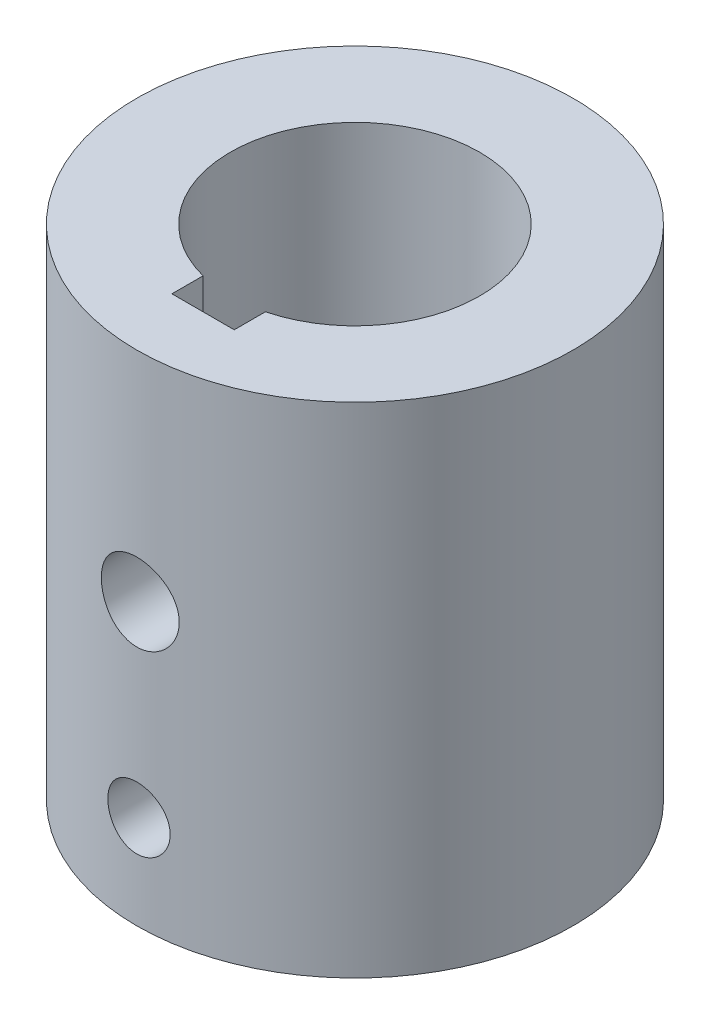
ISO-10303-21;
HEADER;
FILE_DESCRIPTION(('STEP AP214'),'2;1');
FILE_NAME('part.step','',(''),(''),'','','');
FILE_SCHEMA(('AUTOMOTIVE_DESIGN { 1 0 10303 214 1 1 1 1 }'));
ENDSEC;
DATA;
#1=APPLICATION_CONTEXT('core data for automotive mechanical design processes');
#2=APPLICATION_PROTOCOL_DEFINITION('international standard','automotive_design',2000,#1);
#3=PRODUCT_CONTEXT('',#1,'mechanical');
#4=PRODUCT('Part','Part','',(#3));
#5=PRODUCT_RELATED_PRODUCT_CATEGORY('part','',(#4));
#6=PRODUCT_DEFINITION_FORMATION('','',#4);
#7=PRODUCT_DEFINITION_CONTEXT('part definition',#1,'design');
#8=PRODUCT_DEFINITION('design','',#6,#7);
#9=PRODUCT_DEFINITION_SHAPE('','',#8);
#10=(LENGTH_UNIT() NAMED_UNIT(*) SI_UNIT(.MILLI.,.METRE.));
#11=(NAMED_UNIT(*) PLANE_ANGLE_UNIT() SI_UNIT($,.RADIAN.));
#12=(NAMED_UNIT(*) SI_UNIT($,.STERADIAN.) SOLID_ANGLE_UNIT());
#13=UNCERTAINTY_MEASURE_WITH_UNIT(LENGTH_MEASURE(1.E-05),#10,'distance_accuracy_value','');
#14=(GEOMETRIC_REPRESENTATION_CONTEXT(3) GLOBAL_UNCERTAINTY_ASSIGNED_CONTEXT((#13)) GLOBAL_UNIT_ASSIGNED_CONTEXT((#10,
#11,#12)) REPRESENTATION_CONTEXT('',''));
#15=CARTESIAN_POINT('',(0.,0.,0.));
#16=DIRECTION('',(0.,0.,1.));
#17=DIRECTION('',(1.,0.,0.));
#18=AXIS2_PLACEMENT_3D('',#15,#16,#17);
#19=CARTESIAN_POINT('',(0.,50.8,0.));
#20=DIRECTION('',(0.,1.,0.));
#21=DIRECTION('',(0.,0.,1.));
#22=AXIS2_PLACEMENT_3D('',#19,#20,#21);
#23=PLANE('',#22);
#24=DIRECTION('',(0.,0.,-1.));
#25=VECTOR('',#24,1.);
#26=CARTESIAN_POINT('',(3.175,50.8,12.2967221242085));
#27=LINE('',#26,#25);
#28=CARTESIAN_POINT('',(3.175,50.8,15.4717221242086));
#29=VERTEX_POINT('',#28);
#30=CARTESIAN_POINT('',(3.175,50.8,12.2967221242085));
#31=VERTEX_POINT('',#30);
#32=EDGE_CURVE('E89',#29,#31,#27,.T.);
#33=ORIENTED_EDGE('',*,*,#32,.F.);
#34=DIRECTION('',(1.,0.,0.));
#35=VECTOR('',#34,1.);
#36=CARTESIAN_POINT('',(3.175,50.8,15.4717221242086));
#37=LINE('',#36,#35);
#38=CARTESIAN_POINT('',(-3.175,50.8,15.4717221242086));
#39=VERTEX_POINT('',#38);
#40=EDGE_CURVE('E113',#39,#29,#37,.T.);
#41=ORIENTED_EDGE('',*,*,#40,.F.);
#42=DIRECTION('',(0.,0.,1.));
#43=VECTOR('',#42,1.);
#44=CARTESIAN_POINT('',(-3.175,50.8,12.2967221242085));
#45=LINE('',#44,#43);
#46=CARTESIAN_POINT('',(-3.175,50.8,12.2967221242085));
#47=VERTEX_POINT('',#46);
#48=EDGE_CURVE('E100',#47,#39,#45,.T.);
#49=ORIENTED_EDGE('',*,*,#48,.F.);
#50=CARTESIAN_POINT('',(0.,50.8,0.));
#51=DIRECTION('',(0.,1.,0.));
#52=DIRECTION('',(0.,0.,1.));
#53=AXIS2_PLACEMENT_3D('',#50,#51,#52);
#54=CIRCLE('',#53,12.7);
#55=EDGE_CURVE('E108',#31,#47,#54,.T.);
#56=ORIENTED_EDGE('',*,*,#55,.F.);
#57=EDGE_LOOP('',(#33,#41,#49,#56));
#58=FACE_BOUND('',#57,.T.);
#59=CARTESIAN_POINT('',(0.,50.8,0.));
#60=DIRECTION('',(0.,1.,0.));
#61=DIRECTION('',(0.,0.,1.));
#62=AXIS2_PLACEMENT_3D('',#59,#60,#61);
#63=CIRCLE('',#62,22.225);
#64=CARTESIAN_POINT('',(0.,50.8,22.225));
#65=VERTEX_POINT('',#64);
#66=EDGE_CURVE('E121',#65,#65,#63,.T.);
#67=ORIENTED_EDGE('',*,*,#66,.T.);
#68=EDGE_LOOP('',(#67));
#69=FACE_BOUND('',#68,.T.);
#70=ADVANCED_FACE('F17',(#58,#69),#23,.T.);
#71=CARTESIAN_POINT('',(0.,0.,0.));
#72=DIRECTION('',(0.,1.,0.));
#73=DIRECTION('',(0.,0.,1.));
#74=AXIS2_PLACEMENT_3D('',#71,#72,#73);
#75=PLANE('',#74);
#76=CARTESIAN_POINT('',(0.,0.,0.));
#77=DIRECTION('',(0.,1.,0.));
#78=DIRECTION('',(0.,0.,1.));
#79=AXIS2_PLACEMENT_3D('',#76,#77,#78);
#80=CIRCLE('',#79,22.225);
#81=CARTESIAN_POINT('',(0.,0.,22.225));
#82=VERTEX_POINT('',#81);
#83=EDGE_CURVE('E117',#82,#82,#80,.T.);
#84=ORIENTED_EDGE('',*,*,#83,.F.);
#85=EDGE_LOOP('',(#84));
#86=FACE_BOUND('',#85,.T.);
#87=DIRECTION('',(-1.,0.,0.));
#88=VECTOR('',#87,1.);
#89=CARTESIAN_POINT('',(3.175,0.,15.4717221242086));
#90=LINE('',#89,#88);
#91=CARTESIAN_POINT('',(3.175,0.,15.4717221242086));
#92=VERTEX_POINT('',#91);
#93=CARTESIAN_POINT('',(-3.175,0.,15.4717221242086));
#94=VERTEX_POINT('',#93);
#95=EDGE_CURVE('E212',#92,#94,#90,.T.);
#96=ORIENTED_EDGE('',*,*,#95,.F.);
#97=DIRECTION('',(0.,0.,1.));
#98=VECTOR('',#97,1.);
#99=CARTESIAN_POINT('',(3.175,0.,12.2967221242085));
#100=LINE('',#99,#98);
#101=CARTESIAN_POINT('',(3.175,0.,12.2967221242085));
#102=VERTEX_POINT('',#101);
#103=EDGE_CURVE('E213',#102,#92,#100,.T.);
#104=ORIENTED_EDGE('',*,*,#103,.F.);
#105=CARTESIAN_POINT('',(0.,0.,0.));
#106=DIRECTION('',(0.,1.,0.));
#107=DIRECTION('',(0.,0.,1.));
#108=AXIS2_PLACEMENT_3D('',#105,#106,#107);
#109=CIRCLE('',#108,12.7);
#110=CARTESIAN_POINT('',(-3.175,0.,12.2967221242085));
#111=VERTEX_POINT('',#110);
#112=EDGE_CURVE('E118',#102,#111,#109,.T.);
#113=ORIENTED_EDGE('',*,*,#112,.T.);
#114=DIRECTION('',(0.,0.,-1.));
#115=VECTOR('',#114,1.);
#116=CARTESIAN_POINT('',(-3.175,0.,12.2967221242085));
#117=LINE('',#116,#115);
#118=EDGE_CURVE('E215',#94,#111,#117,.T.);
#119=ORIENTED_EDGE('',*,*,#118,.F.);
#120=EDGE_LOOP('',(#96,#104,#113,#119));
#121=FACE_BOUND('',#120,.T.);
#122=ADVANCED_FACE('F196',(#86,#121),#75,.F.);
#123=CARTESIAN_POINT('',(0.,50.8,0.));
#124=DIRECTION('',(0.,-1.,0.));
#125=DIRECTION('',(0.,0.,-1.));
#126=AXIS2_PLACEMENT_3D('',#123,#124,#125);
#127=CYLINDRICAL_SURFACE('',#126,22.225);
#128=CARTESIAN_POINT('',(3.96875,28.575,21.867776485905));
#129=CARTESIAN_POINT('',(3.96874133409613,28.3539888325927,21.8677806526923));
#130=CARTESIAN_POINT('',(3.95022595706883,28.1328629272809,21.8711633805202));
#131=CARTESIAN_POINT('',(3.87669570314425,27.6968326786555,21.8843139592449));
#132=CARTESIAN_POINT('',(3.82164867135281,27.4819339905615,21.8940874351196));
#133=CARTESIAN_POINT('',(3.67678798119663,27.0647308262402,21.9188780868762));
#134=CARTESIAN_POINT('',(3.5870052320976,26.8624153382288,21.9338905996877));
#135=CARTESIAN_POINT('',(3.37530151573148,26.4757358980981,21.9674622811233));
#136=CARTESIAN_POINT('',(3.25338354442913,26.2913702747071,21.9860211190794));
#137=CARTESIAN_POINT('',(2.97940148246222,25.9437236271517,22.0248285849368));
#138=CARTESIAN_POINT('',(2.82704480805626,25.7806748529088,22.0450924124009));
#139=CARTESIAN_POINT('',(2.49714255701685,25.4823110353307,22.0848920530589));
#140=CARTESIAN_POINT('',(2.31959540052913,25.3469977327644,22.1044278204947));
#141=CARTESIAN_POINT('',(1.94283549905543,25.1070638474511,22.1407321830857));
#142=CARTESIAN_POINT('',(1.74348199028282,25.0026610195694,22.1574807982241));
#143=CARTESIAN_POINT('',(1.32971662682327,24.8289131584867,22.1861540356363));
#144=CARTESIAN_POINT('',(1.11530589648431,24.7595655108203,22.1980790176503));
#145=CARTESIAN_POINT('',(0.679916206910108,24.6586113220532,22.2156540318067));
#146=CARTESIAN_POINT('',(0.459030572989992,24.6266137879434,22.2213690275296));
#147=CARTESIAN_POINT('',(0.0149570086426848,24.6000509279964,22.2261037439973));
#148=CARTESIAN_POINT('',(-0.208230741880736,24.6054826989671,22.2251239840187));
#149=CARTESIAN_POINT('',(-0.647895244137165,24.6533221597873,22.2166306392229));
#150=CARTESIAN_POINT('',(-0.864419437420152,24.6953089462127,22.2091914326645));
#151=CARTESIAN_POINT('',(-1.28729901147497,24.8144021870584,22.1886982438103));
#152=CARTESIAN_POINT('',(-1.49365404749925,24.8915098312146,22.1756440713057));
#153=CARTESIAN_POINT('',(-1.89157216028556,25.0790646276421,22.1452623389472));
#154=CARTESIAN_POINT('',(-2.08305312427363,25.1896823200555,22.1279130046067));
#155=CARTESIAN_POINT('',(-2.44489309873475,25.4409918518154,22.0908635843617));
#156=CARTESIAN_POINT('',(-2.61525015195887,25.5816864746734,22.071163280958));
#157=CARTESIAN_POINT('',(-2.93249732470517,25.8914822402813,22.0312743412011));
#158=CARTESIAN_POINT('',(-3.07902784611347,26.0609514781925,22.0110827243585));
#159=CARTESIAN_POINT('',(-3.34163648157585,26.4222534929747,21.9727503239844));
#160=CARTESIAN_POINT('',(-3.45771422797379,26.6140865398034,21.9546095652143));
#161=CARTESIAN_POINT('',(-3.65621061729495,27.015120988537,21.922429686102));
#162=CARTESIAN_POINT('',(-3.73858098140973,27.224346789841,21.9083964570697));
#163=CARTESIAN_POINT('',(-3.86690239857903,27.6539734772031,21.8861137315089));
#164=CARTESIAN_POINT('',(-3.91285716714824,27.8743732207321,21.8778636449312));
#165=CARTESIAN_POINT('',(-3.96652616976176,28.3168599515129,21.868196956012));
#166=CARTESIAN_POINT('',(-3.97475525331385,28.538882544533,21.8666883585372));
#167=CARTESIAN_POINT('',(-3.95411581883786,28.9811306600127,21.870429786804));
#168=CARTESIAN_POINT('',(-3.9252489563191,29.2013562622266,21.8756795109369));
#169=CARTESIAN_POINT('',(-3.83167772312022,29.6320917743511,21.8922606863923));
#170=CARTESIAN_POINT('',(-3.76723977732875,29.8426614578885,21.9035469054858));
#171=CARTESIAN_POINT('',(-3.60463676949827,30.2500146081239,21.9308908830158));
#172=CARTESIAN_POINT('',(-3.50646942568029,30.4467971410426,21.9469489642566));
#173=CARTESIAN_POINT('',(-3.27799596848987,30.8232685007675,21.9822387101283));
#174=CARTESIAN_POINT('',(-3.14736253933816,31.0027556671951,22.001501991259));
#175=CARTESIAN_POINT('',(-2.85810995471773,31.3374472550756,22.0409411759554));
#176=CARTESIAN_POINT('',(-2.69948852676545,31.4926497028003,22.0611171535284));
#177=CARTESIAN_POINT('',(-2.35647125763491,31.7762704496121,22.1004019952987));
#178=CARTESIAN_POINT('',(-2.17178808436836,31.9043437661391,22.1194950865556));
#179=CARTESIAN_POINT('',(-1.78322758299865,32.127644124095,22.1542030997228));
#180=CARTESIAN_POINT('',(-1.57935094420752,32.2228723445468,22.1698181464755));
#181=CARTESIAN_POINT('',(-1.15917559046459,32.3772538232098,22.1957425268997));
#182=CARTESIAN_POINT('',(-0.94294256963217,32.4365813938184,22.2060774589432));
#183=CARTESIAN_POINT('',(-0.503380919967971,32.5180361250246,22.2203859201495));
#184=CARTESIAN_POINT('',(-0.280052967444973,32.5401668205563,22.224360053797));
#185=CARTESIAN_POINT('',(0.16404140637708,32.5464859402782,22.225488659181));
#186=CARTESIAN_POINT('',(0.384800323064924,32.5311970836785,22.2227370840321));
#187=CARTESIAN_POINT('',(0.82055105773798,32.4642496403022,22.2109171439356));
#188=CARTESIAN_POINT('',(1.03554292031014,32.4125913347936,22.2018488278395));
#189=CARTESIAN_POINT('',(1.45341418977593,32.2745831250585,22.1784124656814));
#190=CARTESIAN_POINT('',(1.6563108105391,32.1882839441572,22.1640521709721));
#191=CARTESIAN_POINT('',(2.04482367238512,31.9835042746871,22.1315921246134));
#192=CARTESIAN_POINT('',(2.2304389016075,31.8650219033165,22.113492154198));
#193=CARTESIAN_POINT('',(2.58173772091082,31.5974158679185,22.0752559908291));
#194=CARTESIAN_POINT('',(2.74712932341881,31.4479122138621,22.0550962906701));
#195=CARTESIAN_POINT('',(3.05065987047593,31.1233004470071,22.015167385571));
#196=CARTESIAN_POINT('',(3.18879241412801,30.9481863371995,21.995398273326));
#197=CARTESIAN_POINT('',(3.4349471308505,30.5755974066207,21.958311197813));
#198=CARTESIAN_POINT('',(3.54271094727945,30.3779497014664,21.941014848746));
#199=CARTESIAN_POINT('',(3.72333658010777,29.9671183300967,21.9110894700011));
#200=CARTESIAN_POINT('',(3.79623219722139,29.7539499413751,21.8984559229975));
#201=CARTESIAN_POINT('',(3.88978455565133,29.3792168078487,21.8819955129252));
#202=CARTESIAN_POINT('',(3.91934730292149,29.2198808128656,21.8766941381956));
#203=CARTESIAN_POINT('',(3.95883297382862,28.898717027876,21.8695831386379));
#204=CARTESIAN_POINT('',(3.96875634772028,28.7368892950812,21.8677734337594));
#205=CARTESIAN_POINT('',(3.96875,28.575,21.867776485905));
#206=B_SPLINE_CURVE_WITH_KNOTS('',3,(#128,#129,#130,#131,#132,#133,#134,#135,#136,#137,#138,
#139,#140,#141,#142,#143,#144,#145,#146,#147,#148,#149,#150,#151,#152,#153,#154,#155,#156,#157,
#158,#159,#160,#161,#162,#163,#164,#165,#166,#167,#168,#169,#170,#171,#172,#173,#174,#175,#176,
#177,#178,#179,#180,#181,#182,#183,#184,#185,#186,#187,#188,#189,#190,#191,#192,#193,#194,#195,
#196,#197,#198,#199,#200,#201,#202,#203,#204,#205),.UNSPECIFIED.,.T.,.F.,(4,2,2,2,2,2,2,2,2,2,2,
2,2,2,2,2,2,2,2,2,2,2,2,2,2,2,2,2,2,2,2,2,2,2,2,2,2,2,4),(0.,0.662441264664774,1.3254663799723,
1.98790286030462,2.65027760355655,3.31935536788341,3.98847511286745,4.66220218306647,
5.33587899831952,6.00243844124996,6.66894618328991,7.32787959444333,7.9868353289434,
8.64920264122189,9.31163127976388,9.98327925589566,10.6549353404561,11.3275500935422,
12.000096210324,12.6634360936199,13.3267463745643,13.9851546238275,14.6436074228922,
15.3089889001368,15.974424427865,16.6478718650897,17.3212951254165,17.9914218404763,
18.6614848677216,19.3222412439943,19.9829925102738,20.6427797723399,21.302605642023,
21.9710494011055,22.6396499360239,23.3137776630943,23.9872505697086,24.4724957695729,
24.9577298445175),.UNSPECIFIED.);
#207=CARTESIAN_POINT('',(3.96875,28.575,21.867776485905));
#208=VERTEX_POINT('',#207);
#209=EDGE_CURVE('E142',#208,#208,#206,.T.);
#210=ORIENTED_EDGE('',*,*,#209,.T.);
#211=EDGE_LOOP('',(#210));
#212=FACE_BOUND('',#211,.T.);
#213=CARTESIAN_POINT('',(0.,12.7,-22.225));
#214=CARTESIAN_POINT('',(-0.177372532942854,12.6999926130805,-22.2249972543515));
#215=CARTESIAN_POINT('',(-0.354850399948266,12.6850863672689,-22.2228543413594));
#216=CARTESIAN_POINT('',(-0.704852096668656,12.6258664924571,-22.2145120385616));
#217=CARTESIAN_POINT('',(-0.877370818068792,12.581523599379,-22.2083086121327));
#218=CARTESIAN_POINT('',(-1.21233779879378,12.4647767539938,-22.1925429326379));
#219=CARTESIAN_POINT('',(-1.37479331768552,12.3923933100758,-22.1829831348434));
#220=CARTESIAN_POINT('',(-1.68522538951301,12.2216686513072,-22.1615631533086));
#221=CARTESIAN_POINT('',(-1.83320409151771,12.1233312973276,-22.1497033117895));
#222=CARTESIAN_POINT('',(-2.11156121501146,11.9027442565439,-22.1249093670883));
#223=CARTESIAN_POINT('',(-2.24182175079207,11.7803465089261,-22.1119689131174));
#224=CARTESIAN_POINT('',(-2.4800283513654,11.5154315838366,-22.0865223693237));
#225=CARTESIAN_POINT('',(-2.58797317910011,11.372913291731,-22.0740163036128));
#226=CARTESIAN_POINT('',(-2.77893740764057,11.0710182565293,-22.0507927185792));
#227=CARTESIAN_POINT('',(-2.86184379837958,10.9115693430446,-22.0400834025882));
#228=CARTESIAN_POINT('',(-2.99965570904621,10.5808318371159,-22.0217518243371));
#229=CARTESIAN_POINT('',(-3.05456261243032,10.4095438301172,-22.0141294095569));
#230=CARTESIAN_POINT('',(-3.13445309119421,10.061225718796,-22.0028966652068));
#231=CARTESIAN_POINT('',(-3.15963772607625,9.88424261422916,-21.9992593898744));
#232=CARTESIAN_POINT('',(-3.1799914177403,9.52852772524451,-21.9963267795921));
#233=CARTESIAN_POINT('',(-3.17516204015659,9.34979603252471,-21.9970312181636));
#234=CARTESIAN_POINT('',(-3.13578932460963,8.9970719685675,-22.0026777932302));
#235=CARTESIAN_POINT('',(-3.10146916470387,8.82305410250443,-22.0075880999923));
#236=CARTESIAN_POINT('',(-3.00443812120536,8.48327270104747,-22.0210434511419));
#237=CARTESIAN_POINT('',(-2.94172650310753,8.31750937932705,-22.0295885895644));
#238=CARTESIAN_POINT('',(-2.78945822996728,7.99825910788074,-22.0493862330951));
#239=CARTESIAN_POINT('',(-2.69980630064438,7.84481821817508,-22.0606483183299));
#240=CARTESIAN_POINT('',(-2.4962702351622,7.55507375129897,-22.0846038460095));
#241=CARTESIAN_POINT('',(-2.38238465455235,7.41877119643244,-22.0972973737546));
#242=CARTESIAN_POINT('',(-2.13238543141818,7.16587847011105,-22.1228264578543));
#243=CARTESIAN_POINT('',(-1.99607975680891,7.04947807443464,-22.1356622590839));
#244=CARTESIAN_POINT('',(-1.70576608109782,6.84117725861614,-22.1599225931851));
#245=CARTESIAN_POINT('',(-1.55175801494515,6.7492769285084,-22.1713471208704));
#246=CARTESIAN_POINT('',(-1.23025230140895,6.59257813593975,-22.1915080462026));
#247=CARTESIAN_POINT('',(-1.06274783555435,6.52779347617785,-22.2002430742161));
#248=CARTESIAN_POINT('',(-0.719084634272286,6.42732563490981,-22.2140291032861));
#249=CARTESIAN_POINT('',(-0.542926429752161,6.39164067049386,-22.2190803300435));
#250=CARTESIAN_POINT('',(-0.188595035544039,6.35063559242257,-22.2248999013422));
#251=CARTESIAN_POINT('',(-0.010452639023546,6.34505441923126,-22.2257050662886));
#252=CARTESIAN_POINT('',(0.344225324872356,6.36372363273189,-22.2230417753748));
#253=CARTESIAN_POINT('',(0.520760937101991,6.38797318409458,-22.2195734391824));
#254=CARTESIAN_POINT('',(0.866429588550373,6.46539845728161,-22.2087756505003));
#255=CARTESIAN_POINT('',(1.03559150406069,6.51844781394755,-22.2014630698402));
#256=CARTESIAN_POINT('',(1.36261942363918,6.65183413613148,-22.1837944415749));
#257=CARTESIAN_POINT('',(1.52048494016621,6.73217227854688,-22.1734382627095));
#258=CARTESIAN_POINT('',(1.8215922670791,6.9184739344676,-22.1507427375886));
#259=CARTESIAN_POINT('',(1.96473002515803,7.02460404465742,-22.1383906807312));
#260=CARTESIAN_POINT('',(2.23125553050272,7.25924392073296,-22.1131200870886));
#261=CARTESIAN_POINT('',(2.35464224123725,7.38775486042192,-22.1002015206183));
#262=CARTESIAN_POINT('',(2.57910591335467,7.66466701278109,-22.0751380976941));
#263=CARTESIAN_POINT('',(2.6800084525968,7.81321029160209,-22.0629997770826));
#264=CARTESIAN_POINT('',(2.85542940396839,8.12529043373385,-22.0409844847579));
#265=CARTESIAN_POINT('',(2.92994847564319,8.28882692210919,-22.0311074565181));
#266=CARTESIAN_POINT('',(3.05021314579172,8.62571824590374,-22.0147796029054));
#267=CARTESIAN_POINT('',(3.09605251584503,8.79903904216058,-22.0083176225203));
#268=CARTESIAN_POINT('',(3.15795617455243,9.15101764067578,-21.9995211720729));
#269=CARTESIAN_POINT('',(3.17402231261418,9.32967511073832,-21.9971864456406));
#270=CARTESIAN_POINT('',(3.1758824971906,9.68551819960255,-21.9969178067031));
#271=CARTESIAN_POINT('',(3.16195070821392,9.86270241650281,-21.9989440373804));
#272=CARTESIAN_POINT('',(3.10479592163144,10.2121813219428,-22.0070826718652));
#273=CARTESIAN_POINT('',(3.06157295420644,10.3844760155204,-22.0131950714623));
#274=CARTESIAN_POINT('',(2.94715637335701,10.719221108364,-22.0288038829555));
#275=CARTESIAN_POINT('',(2.8759801345313,10.8816775504238,-22.0382981924558));
#276=CARTESIAN_POINT('',(2.70770451922401,11.1923868813635,-22.0596038634222));
#277=CARTESIAN_POINT('',(2.61060443067045,11.3406393799398,-22.0714152885321));
#278=CARTESIAN_POINT('',(2.39223466597663,11.6201282369146,-22.0961531446146));
#279=CARTESIAN_POINT('',(2.27076147542829,11.7512048205085,-22.1090884059355));
#280=CARTESIAN_POINT('',(2.00752315239733,11.9912125355487,-22.1345414251083));
#281=CARTESIAN_POINT('',(1.86575329213172,12.1001384930142,-22.1470590848466));
#282=CARTESIAN_POINT('',(1.56512168644748,12.2932310206074,-22.1703370170694));
#283=CARTESIAN_POINT('',(1.4061784764587,12.3772718134757,-22.1810882437725));
#284=CARTESIAN_POINT('',(1.07635879528744,12.5173418436097,-22.1995326276888));
#285=CARTESIAN_POINT('',(0.905495085753383,12.5734005285239,-22.2072289979989));
#286=CARTESIAN_POINT('',(0.611523040346122,12.6429826942238,-22.2169095127051));
#287=CARTESIAN_POINT('',(0.490242064945985,12.6643321086395,-22.2199281098463));
#288=CARTESIAN_POINT('',(0.24599093766799,12.6928432469275,-22.2239742949424));
#289=CARTESIAN_POINT('',(0.12302080396911,12.7000051233681,-22.2250019043077));
#290=CARTESIAN_POINT('',(0.,12.7,-22.225));
#291=B_SPLINE_CURVE_WITH_KNOTS('',3,(#213,#214,#215,#216,#217,#218,#219,#220,#221,#222,#223,
#224,#225,#226,#227,#228,#229,#230,#231,#232,#233,#234,#235,#236,#237,#238,#239,#240,#241,#242,
#243,#244,#245,#246,#247,#248,#249,#250,#251,#252,#253,#254,#255,#256,#257,#258,#259,#260,#261,
#262,#263,#264,#265,#266,#267,#268,#269,#270,#271,#272,#273,#274,#275,#276,#277,#278,#279,#280,
#281,#282,#283,#284,#285,#286,#287,#288,#289,#290),.UNSPECIFIED.,.T.,.F.,(4,2,2,2,2,2,2,2,2,2,2,
2,2,2,2,2,2,2,2,2,2,2,2,2,2,2,2,2,2,2,2,2,2,2,2,2,2,2,4),(0.,0.531668122197692,1.06386558878678,
1.59567454771251,2.12740443995392,2.66251510386462,3.19765542336743,3.73517617335121,
4.2726703618259,4.80650738344102,5.34031655851174,5.87012123820307,6.39993962506167,
6.93165421549764,7.46340050774699,7.99996426271881,8.5365299894608,9.07336851324162,
9.61017414298081,10.1423170293666,10.6744450148604,11.2042568290739,11.7340914956542,
12.2674439687877,12.8008244229882,13.3382087300045,13.8755796023068,14.411184168761,
14.9467554642422,15.477452723073,16.0081494350893,16.5385168086807,17.0688987518139,
17.6039089042129,18.1390438820047,18.6768391543641,19.2140672653074,19.5828218978377,
19.9515725648791),.UNSPECIFIED.);
#292=CARTESIAN_POINT('',(0.,12.7,-22.225));
#293=VERTEX_POINT('',#292);
#294=EDGE_CURVE('E124',#293,#293,#291,.T.);
#295=ORIENTED_EDGE('',*,*,#294,.T.);
#296=EDGE_LOOP('',(#295));
#297=FACE_BOUND('',#296,.T.);
#298=CARTESIAN_POINT('',(3.175,9.525,21.9970452561247));
#299=CARTESIAN_POINT('',(3.17499260409125,9.34763787815582,21.9970481082156));
#300=CARTESIAN_POINT('',(3.16008804904672,9.1701703934739,21.9992135575726));
#301=CARTESIAN_POINT('',(3.10087549968881,8.82019026467832,22.0076363111921));
#302=CARTESIAN_POINT('',(3.05653820399453,8.64768273711978,22.0138976930162));
#303=CARTESIAN_POINT('',(2.93980772902895,8.31273943870411,22.0297889769634));
#304=CARTESIAN_POINT('',(2.86743532306302,8.15029631351541,22.0394163844335));
#305=CARTESIAN_POINT('',(2.69673666724122,7.83988505446949,22.0609519822444));
#306=CARTESIAN_POINT('',(2.598414251674,7.69191478657355,22.0728598355627));
#307=CARTESIAN_POINT('',(2.37784238108812,7.41354833034237,22.097711475932));
#308=CARTESIAN_POINT('',(2.25544152078385,7.28327265423791,22.1106614947546));
#309=CARTESIAN_POINT('',(1.99051398786035,7.04503677788058,22.1360825870052));
#310=CARTESIAN_POINT('',(1.84798624218867,6.93707776818356,22.1485536348521));
#311=CARTESIAN_POINT('',(1.54608273463253,6.7460985573065,22.1716764627384));
#312=CARTESIAN_POINT('',(1.38663642886805,6.66318880320199,22.1823200989089));
#313=CARTESIAN_POINT('',(1.05590458421642,6.52536995766709,22.2005199793149));
#314=CARTESIAN_POINT('',(0.884619614487437,6.47045952119727,22.2080763718529));
#315=CARTESIAN_POINT('',(0.536311575871261,6.39056188394423,22.2192064188926));
#316=CARTESIAN_POINT('',(0.359335586048433,6.3653732389286,22.2228068738));
#317=CARTESIAN_POINT('',(0.00363468487945935,6.34500906102552,22.2257111283058));
#318=CARTESIAN_POINT('',(-0.175090137405668,6.3498320076288,22.2250151455792));
#319=CARTESIAN_POINT('',(-0.527842150095067,6.38919438791761,22.2194264377293));
#320=CARTESIAN_POINT('',(-0.701894074636517,6.42351712322599,22.2145643168523));
#321=CARTESIAN_POINT('',(-1.0417422572668,6.52056506352249,22.2012237809256));
#322=CARTESIAN_POINT('',(-1.20753831907824,6.58329094341813,22.1927452799447));
#323=CARTESIAN_POINT('',(-1.52682887224378,6.73558905734392,22.1730719283894));
#324=CARTESIAN_POINT('',(-1.68027888605582,6.82525328990116,22.1618677947259));
#325=CARTESIAN_POINT('',(-1.97003641446851,7.02881578222516,22.1379933588026));
#326=CARTESIAN_POINT('',(-2.10634290346628,7.14271549077111,22.1253229689117));
#327=CARTESIAN_POINT('',(-2.35922024831388,7.39272493016064,22.0997971284829));
#328=CARTESIAN_POINT('',(-2.47560416314842,7.52902376073934,22.0869410354408));
#329=CARTESIAN_POINT('',(-2.68387495974321,7.81931780276931,22.0626034152762));
#330=CARTESIAN_POINT('',(-2.77576171599434,7.97331310488116,22.0511218951963));
#331=CARTESIAN_POINT('',(-2.93245066164262,8.29481496022606,22.0308337272164));
#332=CARTESIAN_POINT('',(-2.99723492899698,8.46233036683863,22.0220288503466));
#333=CARTESIAN_POINT('',(-3.09769865136959,8.8060174079736,22.0081231447171));
#334=CARTESIAN_POINT('',(-3.1333799581498,8.98218849099661,22.0030220802935));
#335=CARTESIAN_POINT('',(-3.17437120217508,9.33652650317019,21.9971458195224));
#336=CARTESIAN_POINT('',(-3.17994555628349,9.51466224126799,21.9963329630993));
#337=CARTESIAN_POINT('',(-3.16126508092304,9.86932526547743,21.9990252889568));
#338=CARTESIAN_POINT('',(-3.1370110882235,10.0458525965695,22.0025303501077));
#339=CARTESIAN_POINT('',(-3.05958617595132,10.3914768357952,22.013429057337));
#340=CARTESIAN_POINT('',(-3.00654586403018,10.5606036042162,22.0208051351058));
#341=CARTESIAN_POINT('',(-2.87318936047198,10.8875652159622,22.0386003729932));
#342=CARTESIAN_POINT('',(-2.79287193790099,11.0453995493042,22.0490196704401));
#343=CARTESIAN_POINT('',(-2.60660134525821,11.3464846090579,22.071816543563));
#344=CARTESIAN_POINT('',(-2.50047633043061,11.4896280259246,22.0842070451803));
#345=CARTESIAN_POINT('',(-2.26584316041416,11.7561673112555,22.1095108174966));
#346=CARTESIAN_POINT('',(-2.13733386064594,11.8795621692939,22.1224241149018));
#347=CARTESIAN_POINT('',(-1.860418374478,12.1040449092637,22.1474355820708));
#348=CARTESIAN_POINT('',(-1.71186978574737,12.2049580041822,22.1595268892944));
#349=CARTESIAN_POINT('',(-1.39977606882427,12.380397456478,22.1814266422619));
#350=CARTESIAN_POINT('',(-1.23623131940512,12.454924480084,22.1912351456428));
#351=CARTESIAN_POINT('',(-0.899344030292867,12.5751941064762,22.2074339607805));
#352=CARTESIAN_POINT('',(-0.726036773609238,12.6210339219461,22.2138358055584));
#353=CARTESIAN_POINT('',(-0.374086848735184,12.6829430540317,22.2225482509749));
#354=CARTESIAN_POINT('',(-0.195444499436413,12.699014146393,22.224859095647));
#355=CARTESIAN_POINT('',(0.160405969870607,12.7008893793244,22.2251271217915));
#356=CARTESIAN_POINT('',(0.337612707029036,12.6869615751918,22.22312286098));
#357=CARTESIAN_POINT('',(0.687137680649307,12.6298068618067,22.2150632703669));
#358=CARTESIAN_POINT('',(0.859455928651812,12.5865800217288,22.2090079501298));
#359=CARTESIAN_POINT('',(1.19425039676433,12.4721461608329,22.1935234001093));
#360=CARTESIAN_POINT('',(1.3567324754534,12.4009559884809,22.1840962022546));
#361=CARTESIAN_POINT('',(1.66748730803941,12.2326445256414,22.1629058916316));
#362=CARTESIAN_POINT('',(1.81575968757259,12.1355225522188,22.1511427173455));
#363=CARTESIAN_POINT('',(2.09524909499351,11.9171280020843,22.1264646284537));
#364=CARTESIAN_POINT('',(2.22631026403017,11.7956569604088,22.1135407654047));
#365=CARTESIAN_POINT('',(2.46628787804759,11.5324293731211,22.0880657969985));
#366=CARTESIAN_POINT('',(2.57519910777256,11.3906680634728,22.0755147800215));
#367=CARTESIAN_POINT('',(2.76827493516724,11.0900441166593,22.052138519243));
#368=CARTESIAN_POINT('',(2.8523113244952,10.9310984540416,22.0413223436744));
#369=CARTESIAN_POINT('',(2.99237245226717,10.6012737292099,22.0227465951902));
#370=CARTESIAN_POINT('',(3.04842668700633,10.4304074501893,22.014983805506));
#371=CARTESIAN_POINT('',(3.11799692575809,10.1364471739847,22.0052152641794));
#372=CARTESIAN_POINT('',(3.13934098015756,10.0151813675332,22.0021674508921));
#373=CARTESIAN_POINT('',(3.16784500269689,9.77096058731926,21.9980814690859));
#374=CARTESIAN_POINT('',(3.17500512927125,9.64800563244007,21.9970432781193));
#375=CARTESIAN_POINT('',(3.175,9.525,21.9970452561247));
#376=B_SPLINE_CURVE_WITH_KNOTS('',3,(#298,#299,#300,#301,#302,#303,#304,#305,#306,#307,#308,
#309,#310,#311,#312,#313,#314,#315,#316,#317,#318,#319,#320,#321,#322,#323,#324,#325,#326,#327,
#328,#329,#330,#331,#332,#333,#334,#335,#336,#337,#338,#339,#340,#341,#342,#343,#344,#345,#346,
#347,#348,#349,#350,#351,#352,#353,#354,#355,#356,#357,#358,#359,#360,#361,#362,#363,#364,#365,
#366,#367,#368,#369,#370,#371,#372,#373,#374,#375),.UNSPECIFIED.,.T.,.F.,(4,2,2,2,2,2,2,2,2,2,2,
2,2,2,2,2,2,2,2,2,2,2,2,2,2,2,2,2,2,2,2,2,2,2,2,2,2,2,4),(0.,0.531636842186743,1.06380374381047,
1.59557707521231,2.12727187746938,2.66242348592818,3.19760363644327,3.73511017448155,
4.27259088918994,4.80640742645055,5.34019691861482,5.87009851040563,6.40001269422942,
6.93175759380701,7.46353428964399,8.00005572303161,8.53657990518866,9.07345831563074,
9.61030256293015,10.1424241696856,10.6745308492685,11.2042432252682,11.7339795087709,
12.267344671057,12.8007371140035,13.3381420041644,13.8755333242788,14.4110935764552,
14.9466218806916,15.477384832952,16.0081465320919,16.5385889260441,17.0690452910066,
17.604015295275,18.1391111140455,18.6769186963043,19.2141581662606,19.5828674249722,
19.9515725651772),.UNSPECIFIED.);
#377=CARTESIAN_POINT('',(3.175,9.525,21.9970452561247));
#378=VERTEX_POINT('',#377);
#379=EDGE_CURVE('E141',#378,#378,#376,.T.);
#380=ORIENTED_EDGE('',*,*,#379,.T.);
#381=EDGE_LOOP('',(#380));
#382=FACE_BOUND('',#381,.T.);
#383=ORIENTED_EDGE('',*,*,#66,.F.);
#384=EDGE_LOOP('',(#383));
#385=FACE_BOUND('',#384,.T.);
#386=ORIENTED_EDGE('',*,*,#83,.T.);
#387=EDGE_LOOP('',(#386));
#388=FACE_BOUND('',#387,.T.);
#389=ADVANCED_FACE('F19',(#212,#297,#382,#385,#388),#127,.T.);
#390=CARTESIAN_POINT('',(0.,50.8,0.));
#391=DIRECTION('',(0.,-1.,0.));
#392=DIRECTION('',(0.,0.,-1.));
#393=AXIS2_PLACEMENT_3D('',#390,#391,#392);
#394=CYLINDRICAL_SURFACE('',#393,12.7);
#395=DIRECTION('',(0.,1.,0.));
#396=VECTOR('',#395,1.);
#397=CARTESIAN_POINT('',(3.175,-7.09951582856183,12.2967221242085));
#398=LINE('',#397,#396);
#399=CARTESIAN_POINT('',(3.175,30.95625,12.2967221242085));
#400=VERTEX_POINT('',#399);
#401=EDGE_CURVE('E92',#400,#31,#398,.T.);
#402=ORIENTED_EDGE('',*,*,#401,.T.);
#403=ORIENTED_EDGE('',*,*,#55,.T.);
#404=DIRECTION('',(0.,1.,0.));
#405=VECTOR('',#404,1.);
#406=CARTESIAN_POINT('',(-3.175,-7.09951582856183,12.2967221242085));
#407=LINE('',#406,#405);
#408=CARTESIAN_POINT('',(-3.175,30.95625,12.2967221242085));
#409=VERTEX_POINT('',#408);
#410=EDGE_CURVE('E231',#409,#47,#407,.T.);
#411=ORIENTED_EDGE('',*,*,#410,.F.);
#412=CARTESIAN_POINT('',(3.96875,28.575,12.0639555468967));
#413=CARTESIAN_POINT('',(3.96874853251649,28.3579981603529,12.0639568842915));
#414=CARTESIAN_POINT('',(3.95089185662995,28.1409814093673,12.0698746252851));
#415=CARTESIAN_POINT('',(3.88014131899213,27.713323539213,12.0928015382143));
#416=CARTESIAN_POINT('',(3.82723798884485,27.5026841590754,12.1098137074621));
#417=CARTESIAN_POINT('',(3.68839077609799,27.0940374363659,12.1528185580417));
#418=CARTESIAN_POINT('',(3.60250535963949,26.8960084598895,12.1787953399196));
#419=CARTESIAN_POINT('',(3.40032702499773,26.5171151906317,12.2367803974434));
#420=CARTESIAN_POINT('',(3.28402873500381,26.3362539378766,12.268789738338));
#421=CARTESIAN_POINT('',(3.02004752422577,25.9906170957082,12.3364665534787));
#422=CARTESIAN_POINT('',(2.87149984411226,25.8265180400407,12.3722169174668));
#423=CARTESIAN_POINT('',(2.54908699749619,25.5251076580608,12.4426423060657));
#424=CARTESIAN_POINT('',(2.37521830174644,25.3878000722001,12.4773171799559));
#425=CARTESIAN_POINT('',(2.00223727216642,25.1408848749393,12.542632820135));
#426=CARTESIAN_POINT('',(1.80264294195131,25.0319739903351,12.5731646098683));
#427=CARTESIAN_POINT('',(1.38685343930956,24.8495310417086,12.6257860206983));
#428=CARTESIAN_POINT('',(1.17066218269639,24.7759906620751,12.6478776258325));
#429=CARTESIAN_POINT('',(0.73489933336736,24.6686351682918,12.6805428323124));
#430=CARTESIAN_POINT('',(0.515638146611589,24.6336637444236,12.6914509627465));
#431=CARTESIAN_POINT('',(0.0741070844008561,24.6007752000609,12.7017016690635));
#432=CARTESIAN_POINT('',(-0.148162095639544,24.6028496564108,12.7010468740197));
#433=CARTESIAN_POINT('',(-0.58126147512627,24.6432333257854,12.6884784372079));
#434=CARTESIAN_POINT('',(-0.792221663947052,24.6802890426538,12.6769542933654));
#435=CARTESIAN_POINT('',(-1.2047634761292,24.7875265933866,12.6444210713078));
#436=CARTESIAN_POINT('',(-1.40634448690292,24.85771058765,12.6234113745139));
#437=CARTESIAN_POINT('',(-1.79729797751629,25.0300178503125,12.5737448464102));
#438=CARTESIAN_POINT('',(-1.986490837852,25.1325215171867,12.5449975673293));
#439=CARTESIAN_POINT('',(-2.34538047290817,25.3662532415629,12.4828847037847));
#440=CARTESIAN_POINT('',(-2.51507230096486,25.4974885627659,12.4495179522495));
#441=CARTESIAN_POINT('',(-2.83761719258917,25.7913937904907,12.3800765457896));
#442=CARTESIAN_POINT('',(-2.98947379336681,25.9551457935578,12.3439469905188));
#443=CARTESIAN_POINT('',(-3.26386743274751,26.3061294483057,12.2742520403678));
#444=CARTESIAN_POINT('',(-3.38640101789398,26.4933638616244,12.2406869478284));
#445=CARTESIAN_POINT('',(-3.59982976435592,26.888812963591,12.1796443805944));
#446=CARTESIAN_POINT('',(-3.69035586221749,27.0972388235463,12.1522391668376));
#447=CARTESIAN_POINT('',(-3.83471248377107,27.5274388865984,12.1074670626035));
#448=CARTESIAN_POINT('',(-3.88855619178879,27.7492082625671,12.090096565806));
#449=CARTESIAN_POINT('',(-3.95609715466835,28.1902533494324,12.0681611381736));
#450=CARTESIAN_POINT('',(-3.97132030073623,28.4092713380465,12.0631098080018));
#451=CARTESIAN_POINT('',(-3.96547163781533,28.8467474292471,12.0650342093526));
#452=CARTESIAN_POINT('',(-3.94440543703715,29.0652056131214,12.0720080824823));
#453=CARTESIAN_POINT('',(-3.86793973404381,29.4887913418714,12.0967169001143));
#454=CARTESIAN_POINT('',(-3.81355063934747,29.6941216951856,12.1141348427389));
#455=CARTESIAN_POINT('',(-3.67316936373721,30.0927191895868,12.1574333727713));
#456=CARTESIAN_POINT('',(-3.58717202843404,30.2859843571746,12.1833153403409));
#457=CARTESIAN_POINT('',(-3.38320096332413,30.6610991735255,12.2415471339902));
#458=CARTESIAN_POINT('',(-3.26438093276172,30.8424624945071,12.2740611607997));
#459=CARTESIAN_POINT('',(-2.99912534755837,31.183231849699,12.3415535798866));
#460=CARTESIAN_POINT('',(-2.85268261914322,31.3426321613379,12.3765326108584));
#461=CARTESIAN_POINT('',(-2.52911910911769,31.6417654117732,12.4467679551153));
#462=CARTESIAN_POINT('',(-2.35097843807856,31.7804094709941,12.4819756800704));
#463=CARTESIAN_POINT('',(-1.97310865744319,32.025879062545,12.5472526500367));
#464=CARTESIAN_POINT('',(-1.77338053726988,32.1327060523125,12.5773221303875));
#465=CARTESIAN_POINT('',(-1.35923503657857,32.3104845358476,12.6287629037303));
#466=CARTESIAN_POINT('',(-1.14493733510093,32.3816957389037,12.6501969360681));
#467=CARTESIAN_POINT('',(-0.70661928162904,32.4868303100223,12.6822277040923));
#468=CARTESIAN_POINT('',(-0.482601994980633,32.5207653465901,12.6928278310283));
#469=CARTESIAN_POINT('',(-0.0412271738602527,32.549436430555,12.7017717580917));
#470=CARTESIAN_POINT('',(0.176019434430209,32.5457453292922,12.7006073586846));
#471=CARTESIAN_POINT('',(0.606657479606313,32.5030724999204,12.6873310540733));
#472=CARTESIAN_POINT('',(0.82004916692013,32.4640930727256,12.6752198626356));
#473=CARTESIAN_POINT('',(1.23429750117651,32.3529515207193,12.6415663743223));
#474=CARTESIAN_POINT('',(1.4352775410771,32.281210495091,12.6201439227365));
#475=CARTESIAN_POINT('',(1.82244500096278,32.1069626236131,12.5700772724174));
#476=CARTESIAN_POINT('',(2.00862987679647,32.0044505008344,12.5414318351506));
#477=CARTESIAN_POINT('',(2.36779338152876,31.7675489922564,12.4786992260472));
#478=CARTESIAN_POINT('',(2.54010987739364,31.6321963161769,12.444460434593));
#479=CARTESIAN_POINT('',(2.86010601269284,31.335154851017,12.3748398853692));
#480=CARTESIAN_POINT('',(3.0077782538757,31.1734581821074,12.3394577881682));
#481=CARTESIAN_POINT('',(3.27923099268226,30.8218975895045,12.2701650893337));
#482=CARTESIAN_POINT('',(3.40205783883208,30.6312779451049,12.2363420774147));
#483=CARTESIAN_POINT('',(3.61379994626556,30.2310859681455,12.1754939776251));
#484=CARTESIAN_POINT('',(3.70272892306257,30.0215213435204,12.148466141849));
#485=CARTESIAN_POINT('',(3.8376599788364,29.6077556900259,12.1064832939804));
#486=CARTESIAN_POINT('',(3.88667433985248,29.4046194118413,12.090695752639));
#487=CARTESIAN_POINT('',(3.95221605466117,28.9926590830936,12.0694325058162));
#488=CARTESIAN_POINT('',(3.96875141226471,28.7838364466852,12.0639542598257));
#489=CARTESIAN_POINT('',(3.96875,28.575,12.0639555468967));
#490=B_SPLINE_CURVE_WITH_KNOTS('',3,(#412,#413,#414,#415,#416,#417,#418,#419,#420,#421,#422,
#423,#424,#425,#426,#427,#428,#429,#430,#431,#432,#433,#434,#435,#436,#437,#438,#439,#440,#441,
#442,#443,#444,#445,#446,#447,#448,#449,#450,#451,#452,#453,#454,#455,#456,#457,#458,#459,#460,
#461,#462,#463,#464,#465,#466,#467,#468,#469,#470,#471,#472,#473,#474,#475,#476,#477,#478,#479,
#480,#481,#482,#483,#484,#485,#486,#487,#488,#489),.UNSPECIFIED.,.T.,.F.,(4,2,2,2,2,2,2,2,2,2,2,
2,2,2,2,2,2,2,2,2,2,2,2,2,2,2,2,2,2,2,2,2,2,2,2,2,2,2,4),(0.,0.65023408671646,1.30064391591467,
1.94990607007651,2.59928298063672,3.26888730748912,3.93858505338064,4.62342934734852,
5.30811255551901,5.97165820002818,6.63505297547883,7.27554370928957,7.91607621728544,
8.56444834631697,9.2129845811437,9.88854826126034,10.5641914653574,11.2473889522044,
11.9303407555771,12.5858566319692,13.2412712130333,13.8777336124857,14.5142998466166,
15.1691217226573,15.8241138944544,16.5062515255927,17.1883579053947,17.8654150975664,
18.5422602910408,19.1909319775321,19.8395613715579,20.4800786269208,21.1207057872721,
21.7830620061678,22.4456167093442,23.1301225072563,23.8143510505986,24.4402722513687,
25.0660391868209),.UNSPECIFIED.);
#491=CARTESIAN_POINT('',(-3.175,26.19375,12.2967221242085));
#492=VERTEX_POINT('',#491);
#493=EDGE_CURVE('E165',#492,#409,#490,.T.);
#494=ORIENTED_EDGE('',*,*,#493,.F.);
#495=EDGE_CURVE('E230',#111,#492,#407,.T.);
#496=ORIENTED_EDGE('',*,*,#495,.F.);
#497=ORIENTED_EDGE('',*,*,#112,.F.);
#498=CARTESIAN_POINT('',(3.175,26.19375,12.2967221242085));
#499=VERTEX_POINT('',#498);
#500=EDGE_CURVE('E112',#102,#499,#398,.T.);
#501=ORIENTED_EDGE('',*,*,#500,.T.);
#502=EDGE_CURVE('E111',#400,#499,#490,.T.);
#503=ORIENTED_EDGE('',*,*,#502,.F.);
#504=EDGE_LOOP('',(#402,#403,#411,#494,#496,#497,#501,#503));
#505=FACE_BOUND('',#504,.T.);
#506=CARTESIAN_POINT('',(0.,12.7,-12.7));
#507=CARTESIAN_POINT('',(-0.175421054350931,12.6999950771876,-12.6999970338729));
#508=CARTESIAN_POINT('',(-0.350897100741782,12.6854128841955,-12.6963292371237));
#509=CARTESIAN_POINT('',(-0.696820051980962,12.6275567630668,-12.6820530760661));
#510=CARTESIAN_POINT('',(-0.867264049209733,12.5842665731449,-12.6714407780562));
#511=CARTESIAN_POINT('',(-1.19807751278646,12.4704702468386,-12.6444507573613));
#512=CARTESIAN_POINT('',(-1.35845880926018,12.3999967927193,-12.6280799601569));
#513=CARTESIAN_POINT('',(-1.66512267919771,12.2339493910717,-12.591316443928));
#514=CARTESIAN_POINT('',(-1.81140477687155,12.1383745968815,-12.5709235892463));
#515=CARTESIAN_POINT('',(-2.08873074612027,11.9227583285653,-12.5278602543575));
#516=CARTESIAN_POINT('',(-2.21944287729591,11.8022971663366,-12.5051546346353));
#517=CARTESIAN_POINT('',(-2.45903522924703,11.5412261662759,-12.4602582924963));
#518=CARTESIAN_POINT('',(-2.56791298487579,11.400614056429,-12.4380676284689));
#519=CARTESIAN_POINT('',(-2.76230618225783,11.1006567700734,-12.3963594189446));
#520=CARTESIAN_POINT('',(-2.84745052370821,10.9410643281215,-12.3768864828385));
#521=CARTESIAN_POINT('',(-2.98957345643241,10.6092658619863,-12.343330973648));
#522=CARTESIAN_POINT('',(-3.04655655068163,10.4370618594472,-12.3292475388652));
#523=CARTESIAN_POINT('',(-3.12960773790342,10.0885762621398,-12.3084267567388));
#524=CARTESIAN_POINT('',(-3.15627230130284,9.91244547005292,-12.3015478927701));
#525=CARTESIAN_POINT('',(-3.17978742389056,9.55808652895139,-12.2954915053947));
#526=CARTESIAN_POINT('',(-3.176642833515,9.37985872586831,-12.2963127290578));
#527=CARTESIAN_POINT('',(-3.14110481048738,9.03093654027234,-12.3054365167726));
#528=CARTESIAN_POINT('',(-3.10942215340351,8.86016426789838,-12.3135572669877));
#529=CARTESIAN_POINT('',(-3.01884119561133,8.52643910890493,-12.3360753547043));
#530=CARTESIAN_POINT('',(-2.95994095604688,8.36348678025545,-12.3504731393489));
#531=CARTESIAN_POINT('',(-2.81599106163371,8.04812119893299,-12.3840899110031));
#532=CARTESIAN_POINT('',(-2.73068344564301,7.89583093637875,-12.4033560981111));
#533=CARTESIAN_POINT('',(-2.53652078423164,7.60747206434806,-12.4445122129068));
#534=CARTESIAN_POINT('',(-2.42766161831204,7.47140629992432,-12.4664025994163));
#535=CARTESIAN_POINT('',(-2.18580424890858,7.21528568011351,-12.5111061380944));
#536=CARTESIAN_POINT('',(-2.05220624645107,7.09579799603681,-12.533927803951));
#537=CARTESIAN_POINT('',(-1.76659522538283,6.88081503678474,-12.5773596047503));
#538=CARTESIAN_POINT('',(-1.61458164448181,6.78532049447545,-12.5979696721291));
#539=CARTESIAN_POINT('',(-1.29564529770895,6.62082625915838,-12.6347586626604));
#540=CARTESIAN_POINT('',(-1.12867311562492,6.55191869646146,-12.6509221227036));
#541=CARTESIAN_POINT('',(-0.785020883902435,6.44330836958141,-12.676884242985));
#542=CARTESIAN_POINT('',(-0.608342698201859,6.40360001891494,-12.6866841206814));
#543=CARTESIAN_POINT('',(-0.255142937325556,6.35538148623379,-12.6986347345774));
#544=CARTESIAN_POINT('',(-0.0787330573083772,6.34609892814061,-12.7009747992585));
#545=CARTESIAN_POINT('',(0.273119584996527,6.35687705435078,-12.6982813685726));
#546=CARTESIAN_POINT('',(0.448562432914396,6.37693509725818,-12.6932485369526));
#547=CARTESIAN_POINT('',(0.790816868910239,6.44518842276175,-12.6764961338622));
#548=CARTESIAN_POINT('',(0.957717835150523,6.49296234102626,-12.6648767569325));
#549=CARTESIAN_POINT('',(1.28112793569116,6.61480999452691,-12.6362609570897));
#550=CARTESIAN_POINT('',(1.43763601861911,6.68888638579632,-12.6192639911647));
#551=CARTESIAN_POINT('',(1.73889063454314,6.8627331394514,-12.5813250177716));
#552=CARTESIAN_POINT('',(1.88337918521904,6.96293610457274,-12.5603183592593));
#553=CARTESIAN_POINT('',(2.15376466554501,7.18563864028733,-12.5167921111412));
#554=CARTESIAN_POINT('',(2.27965837982672,7.30814205885733,-12.4942722608556));
#555=CARTESIAN_POINT('',(2.51246336908675,7.57555415045255,-12.4495762556412));
#556=CARTESIAN_POINT('',(2.6188328531313,7.72093897134919,-12.4274221051899));
#557=CARTESIAN_POINT('',(2.80566443991221,8.02795074295838,-12.3865825924258));
#558=CARTESIAN_POINT('',(2.88612769264178,8.189576972287,-12.3678970761538));
#559=CARTESIAN_POINT('',(3.0182638402854,8.52361711242697,-12.3363163381503));
#560=CARTESIAN_POINT('',(3.07010730622843,8.69596014659597,-12.3233869021911));
#561=CARTESIAN_POINT('',(3.14398164687971,9.04728873345877,-12.3047494152553));
#562=CARTESIAN_POINT('',(3.16601904149253,9.22627282465607,-12.299039785006));
#563=CARTESIAN_POINT('',(3.17931501621074,9.5802895005204,-12.2956087422145));
#564=CARTESIAN_POINT('',(3.17143955029538,9.75528790438749,-12.2976625750886));
#565=CARTESIAN_POINT('',(3.1271152390873,10.1013765643763,-12.3090074061494));
#566=CARTESIAN_POINT('',(3.09066696801938,10.2724668989669,-12.3182982588945));
#567=CARTESIAN_POINT('',(2.99070462615691,10.6049412383437,-12.3429450180984));
#568=CARTESIAN_POINT('',(2.92735297324093,10.7663769627554,-12.3582644892528));
#569=CARTESIAN_POINT('',(2.7755107337966,11.0764433934137,-12.3932474960913));
#570=CARTESIAN_POINT('',(2.68701666057215,11.2250723199131,-12.4129116342002));
#571=CARTESIAN_POINT('',(2.48468673461549,11.5094906313868,-12.4550092586011));
#572=CARTESIAN_POINT('',(2.37025002816433,11.6448439387472,-12.4775016056118));
#573=CARTESIAN_POINT('',(2.12045416901821,11.8947079114838,-12.5223699100401));
#574=CARTESIAN_POINT('',(1.98509005500274,12.0092136204058,-12.5447458385544));
#575=CARTESIAN_POINT('',(1.6943230585205,12.2161539364617,-12.5873437112106));
#576=CARTESIAN_POINT('',(1.53860166056969,12.3081512656048,-12.6075193062447));
#577=CARTESIAN_POINT('',(1.21341315929717,12.4645154632241,-12.6429542453062));
#578=CARTESIAN_POINT('',(1.04395600927443,12.5289021300394,-12.6582171100619));
#579=CARTESIAN_POINT('',(0.729001702698681,12.6186603741978,-12.6798505941374));
#580=CARTESIAN_POINT('',(0.585004695088744,12.6490967977964,-12.6873547169486));
#581=CARTESIAN_POINT('',(0.294017851418465,12.6897679139998,-12.6974304774095));
#582=CARTESIAN_POINT('',(0.147028241296871,12.7000041260296,-12.7000024860439));
#583=CARTESIAN_POINT('',(0.,12.7,-12.7));
#584=B_SPLINE_CURVE_WITH_KNOTS('',3,(#506,#507,#508,#509,#510,#511,#512,#513,#514,#515,#516,
#517,#518,#519,#520,#521,#522,#523,#524,#525,#526,#527,#528,#529,#530,#531,#532,#533,#534,#535,
#536,#537,#538,#539,#540,#541,#542,#543,#544,#545,#546,#547,#548,#549,#550,#551,#552,#553,#554,
#555,#556,#557,#558,#559,#560,#561,#562,#563,#564,#565,#566,#567,#568,#569,#570,#571,#572,#573,
#574,#575,#576,#577,#578,#579,#580,#581,#582,#583),.UNSPECIFIED.,.T.,.F.,(4,2,2,2,2,2,2,2,2,2,2,
2,2,2,2,2,2,2,2,2,2,2,2,2,2,2,2,2,2,2,2,2,2,2,2,2,2,2,4),(0.,0.525724358065501,1.05174676993359,
1.57713870983893,2.10254837335842,2.63767221675278,3.17285644277798,3.71599137305291,
4.25903942808496,4.79120824630597,5.3232904734557,5.84247618671884,6.36169889010143,
6.8861628400674,7.41071862276906,7.95023177058119,8.48976139571985,9.0311441807632,
9.57242335981322,10.09985087283,10.6272309069567,11.1467958106174,11.6664131950588,
12.1952509368702,12.7241800170734,13.266092111565,13.8079801469349,14.34660272276,
14.8851074589671,15.4081433519175,15.9311687337377,16.4510804786766,16.9710643590661,
17.5046127008448,18.0382877269755,18.5816279265763,19.1245778677202,19.5652441424438,
20.005877269746),.UNSPECIFIED.);
#585=CARTESIAN_POINT('',(0.,12.7,-12.7));
#586=VERTEX_POINT('',#585);
#587=EDGE_CURVE('E135',#586,#586,#584,.T.);
#588=ORIENTED_EDGE('',*,*,#587,.F.);
#589=EDGE_LOOP('',(#588));
#590=FACE_BOUND('',#589,.T.);
#591=ADVANCED_FACE('F105',(#505,#590),#394,.F.);
#592=CARTESIAN_POINT('',(0.,9.525,-22.225));
#593=DIRECTION('',(0.,0.,1.));
#594=DIRECTION('',(1.,0.,0.));
#595=AXIS2_PLACEMENT_3D('',#592,#593,#594);
#596=CYLINDRICAL_SURFACE('',#595,3.175);
#597=CARTESIAN_POINT('',(0.,9.525,15.4717221242086));
#598=DIRECTION('',(0.,0.,1.));
#599=DIRECTION('',(1.,0.,0.));
#600=AXIS2_PLACEMENT_3D('',#597,#598,#599);
#601=CIRCLE('',#600,3.175);
#602=CARTESIAN_POINT('',(-3.175,9.525,15.4717221242086));
#603=VERTEX_POINT('',#602);
#604=CARTESIAN_POINT('',(3.175,9.525,15.4717221242086));
#605=VERTEX_POINT('',#604);
#606=EDGE_CURVE('E219',#603,#605,#601,.F.);
#607=ORIENTED_EDGE('',*,*,#606,.T.);
#608=EDGE_CURVE('E233',#605,#603,#601,.F.);
#609=ORIENTED_EDGE('',*,*,#608,.T.);
#610=EDGE_LOOP('',(#607,#609));
#611=FACE_BOUND('',#610,.T.);
#612=ORIENTED_EDGE('',*,*,#379,.F.);
#613=EDGE_LOOP('',(#612));
#614=FACE_BOUND('',#613,.T.);
#615=ADVANCED_FACE('F151',(#611,#614),#596,.F.);
#616=ORIENTED_EDGE('',*,*,#587,.T.);
#617=EDGE_LOOP('',(#616));
#618=FACE_BOUND('',#617,.T.);
#619=ORIENTED_EDGE('',*,*,#294,.F.);
#620=EDGE_LOOP('',(#619));
#621=FACE_BOUND('',#620,.T.);
#622=ADVANCED_FACE('F146',(#618,#621),#596,.F.);
#623=CARTESIAN_POINT('',(0.,28.575,22.225));
#624=DIRECTION('',(0.,0.,1.));
#625=DIRECTION('',(1.,0.,0.));
#626=AXIS2_PLACEMENT_3D('',#623,#624,#625);
#627=CYLINDRICAL_SURFACE('',#626,3.96875);
#628=ORIENTED_EDGE('',*,*,#502,.T.);
#629=DIRECTION('',(0.,0.,1.));
#630=VECTOR('',#629,1.);
#631=CARTESIAN_POINT('',(3.175,26.19375,22.225));
#632=LINE('',#631,#630);
#633=CARTESIAN_POINT('',(3.175,26.19375,15.4717221242086));
#634=VERTEX_POINT('',#633);
#635=EDGE_CURVE('E11',#499,#634,#632,.T.);
#636=ORIENTED_EDGE('',*,*,#635,.T.);
#637=CARTESIAN_POINT('',(0.,28.575,15.4717221242086));
#638=DIRECTION('',(0.,0.,1.));
#639=DIRECTION('',(1.,0.,0.));
#640=AXIS2_PLACEMENT_3D('',#637,#638,#639);
#641=CIRCLE('',#640,3.96875);
#642=CARTESIAN_POINT('',(-3.175,26.19375,15.4717221242086));
#643=VERTEX_POINT('',#642);
#644=EDGE_CURVE('E26',#634,#643,#641,.F.);
#645=ORIENTED_EDGE('',*,*,#644,.T.);
#646=DIRECTION('',(0.,0.,1.));
#647=VECTOR('',#646,1.);
#648=CARTESIAN_POINT('',(-3.175,26.19375,22.225));
#649=LINE('',#648,#647);
#650=EDGE_CURVE('E244',#643,#492,#649,.F.);
#651=ORIENTED_EDGE('',*,*,#650,.T.);
#652=ORIENTED_EDGE('',*,*,#493,.T.);
#653=DIRECTION('',(0.,0.,1.));
#654=VECTOR('',#653,1.);
#655=CARTESIAN_POINT('',(-3.175,30.95625,22.225));
#656=LINE('',#655,#654);
#657=CARTESIAN_POINT('',(-3.175,30.95625,15.4717221242086));
#658=VERTEX_POINT('',#657);
#659=EDGE_CURVE('E133',#409,#658,#656,.T.);
#660=ORIENTED_EDGE('',*,*,#659,.T.);
#661=CARTESIAN_POINT('',(3.175,30.95625,15.4717221242086));
#662=VERTEX_POINT('',#661);
#663=EDGE_CURVE('E247',#658,#662,#641,.F.);
#664=ORIENTED_EDGE('',*,*,#663,.T.);
#665=DIRECTION('',(0.,0.,1.));
#666=VECTOR('',#665,1.);
#667=CARTESIAN_POINT('',(3.175,30.95625,22.225));
#668=LINE('',#667,#666);
#669=EDGE_CURVE('E248',#662,#400,#668,.F.);
#670=ORIENTED_EDGE('',*,*,#669,.T.);
#671=EDGE_LOOP('',(#628,#636,#645,#651,#652,#660,#664,#670));
#672=FACE_BOUND('',#671,.T.);
#673=ORIENTED_EDGE('',*,*,#209,.F.);
#674=EDGE_LOOP('',(#673));
#675=FACE_BOUND('',#674,.T.);
#676=ADVANCED_FACE('F150',(#672,#675),#627,.F.);
#677=CARTESIAN_POINT('',(-3.175,-7.09951582856183,12.2967221242085));
#678=DIRECTION('',(-1.,0.,0.));
#679=DIRECTION('',(0.,0.,1.));
#680=AXIS2_PLACEMENT_3D('',#677,#678,#679);
#681=PLANE('',#680);
#682=ORIENTED_EDGE('',*,*,#410,.T.);
#683=ORIENTED_EDGE('',*,*,#48,.T.);
#684=DIRECTION('',(0.,1.,0.));
#685=VECTOR('',#684,1.);
#686=CARTESIAN_POINT('',(-3.175,-7.09951582856183,15.4717221242086));
#687=LINE('',#686,#685);
#688=EDGE_CURVE('E41',#658,#39,#687,.T.);
#689=ORIENTED_EDGE('',*,*,#688,.F.);
#690=ORIENTED_EDGE('',*,*,#659,.F.);
#691=EDGE_LOOP('',(#682,#683,#689,#690));
#692=FACE_BOUND('',#691,.T.);
#693=ADVANCED_FACE('F172',(#692),#681,.F.);
#694=CARTESIAN_POINT('',(3.175,-7.09951582856183,15.4717221242086));
#695=DIRECTION('',(0.,0.,1.));
#696=DIRECTION('',(1.,0.,0.));
#697=AXIS2_PLACEMENT_3D('',#694,#695,#696);
#698=PLANE('',#697);
#699=ORIENTED_EDGE('',*,*,#688,.T.);
#700=ORIENTED_EDGE('',*,*,#40,.T.);
#701=DIRECTION('',(0.,1.,0.));
#702=VECTOR('',#701,1.);
#703=CARTESIAN_POINT('',(3.175,-7.09951582856183,15.4717221242086));
#704=LINE('',#703,#702);
#705=EDGE_CURVE('E95',#662,#29,#704,.T.);
#706=ORIENTED_EDGE('',*,*,#705,.F.);
#707=ORIENTED_EDGE('',*,*,#663,.F.);
#708=EDGE_LOOP('',(#699,#700,#706,#707));
#709=FACE_BOUND('',#708,.T.);
#710=ADVANCED_FACE('F186',(#709),#698,.F.);
#711=CARTESIAN_POINT('',(3.175,-7.09951582856183,12.2967221242085));
#712=DIRECTION('',(1.,0.,0.));
#713=DIRECTION('',(0.,0.,-1.));
#714=AXIS2_PLACEMENT_3D('',#711,#712,#713);
#715=PLANE('',#714);
#716=ORIENTED_EDGE('',*,*,#705,.T.);
#717=ORIENTED_EDGE('',*,*,#32,.T.);
#718=ORIENTED_EDGE('',*,*,#401,.F.);
#719=ORIENTED_EDGE('',*,*,#669,.F.);
#720=EDGE_LOOP('',(#716,#717,#718,#719));
#721=FACE_BOUND('',#720,.T.);
#722=ADVANCED_FACE('F91',(#721),#715,.F.);
#723=EDGE_CURVE('E226',#605,#634,#704,.T.);
#724=ORIENTED_EDGE('',*,*,#723,.T.);
#725=ORIENTED_EDGE('',*,*,#635,.F.);
#726=ORIENTED_EDGE('',*,*,#500,.F.);
#727=ORIENTED_EDGE('',*,*,#103,.T.);
#728=EDGE_CURVE('E33',#92,#605,#704,.T.);
#729=ORIENTED_EDGE('',*,*,#728,.T.);
#730=EDGE_LOOP('',(#724,#725,#726,#727,#729));
#731=FACE_BOUND('',#730,.T.);
#732=ADVANCED_FACE('F174',(#731),#715,.F.);
#733=ORIENTED_EDGE('',*,*,#728,.F.);
#734=ORIENTED_EDGE('',*,*,#95,.T.);
#735=EDGE_CURVE('E227',#94,#603,#687,.T.);
#736=ORIENTED_EDGE('',*,*,#735,.T.);
#737=ORIENTED_EDGE('',*,*,#608,.F.);
#738=EDGE_LOOP('',(#733,#734,#736,#737));
#739=FACE_BOUND('',#738,.T.);
#740=ADVANCED_FACE('F178',(#739),#698,.F.);
#741=EDGE_CURVE('E229',#603,#643,#687,.T.);
#742=ORIENTED_EDGE('',*,*,#741,.T.);
#743=ORIENTED_EDGE('',*,*,#644,.F.);
#744=ORIENTED_EDGE('',*,*,#723,.F.);
#745=ORIENTED_EDGE('',*,*,#606,.F.);
#746=EDGE_LOOP('',(#742,#743,#744,#745));
#747=FACE_BOUND('',#746,.T.);
#748=ADVANCED_FACE('F182',(#747),#698,.F.);
#749=ORIENTED_EDGE('',*,*,#735,.F.);
#750=ORIENTED_EDGE('',*,*,#118,.T.);
#751=ORIENTED_EDGE('',*,*,#495,.T.);
#752=ORIENTED_EDGE('',*,*,#650,.F.);
#753=ORIENTED_EDGE('',*,*,#741,.F.);
#754=EDGE_LOOP('',(#749,#750,#751,#752,#753));
#755=FACE_BOUND('',#754,.T.);
#756=ADVANCED_FACE('F179',(#755),#681,.F.);
#757=CLOSED_SHELL('',(#70,#122,#389,#591,#615,#622,#676,#693,#710,#722,#732,#740,#748,#756));
#758=MANIFOLD_SOLID_BREP('B1',#757);
#759=ADVANCED_BREP_SHAPE_REPRESENTATION('',(#18,#758),#14);
#760=SHAPE_DEFINITION_REPRESENTATION(#9,#759);
ENDSEC;
END-ISO-10303-21;
